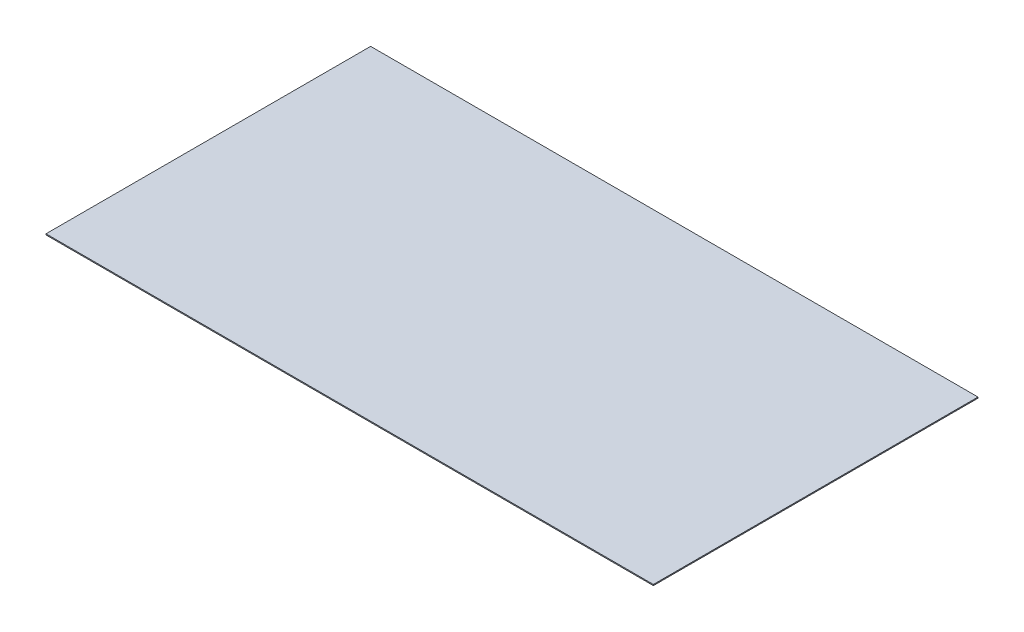
ISO-10303-21;
HEADER;
FILE_DESCRIPTION(('STEP AP214'),'2;1');
FILE_NAME('part.step','',(''),(''),'','','');
FILE_SCHEMA(('AUTOMOTIVE_DESIGN { 1 0 10303 214 1 1 1 1 }'));
ENDSEC;
DATA;
#1=APPLICATION_CONTEXT('core data for automotive mechanical design processes');
#2=APPLICATION_PROTOCOL_DEFINITION('international standard','automotive_design',2000,#1);
#3=PRODUCT_CONTEXT('',#1,'mechanical');
#4=PRODUCT('Part','Part','',(#3));
#5=PRODUCT_RELATED_PRODUCT_CATEGORY('part','',(#4));
#6=PRODUCT_DEFINITION_FORMATION('','',#4);
#7=PRODUCT_DEFINITION_CONTEXT('part definition',#1,'design');
#8=PRODUCT_DEFINITION('design','',#6,#7);
#9=PRODUCT_DEFINITION_SHAPE('','',#8);
#10=(LENGTH_UNIT() NAMED_UNIT(*) SI_UNIT(.MILLI.,.METRE.));
#11=(NAMED_UNIT(*) PLANE_ANGLE_UNIT() SI_UNIT($,.RADIAN.));
#12=(NAMED_UNIT(*) SI_UNIT($,.STERADIAN.) SOLID_ANGLE_UNIT());
#13=UNCERTAINTY_MEASURE_WITH_UNIT(LENGTH_MEASURE(1.E-05),#10,'distance_accuracy_value','');
#14=(GEOMETRIC_REPRESENTATION_CONTEXT(3) GLOBAL_UNCERTAINTY_ASSIGNED_CONTEXT((#13)) GLOBAL_UNIT_ASSIGNED_CONTEXT((#10,
#11,#12)) REPRESENTATION_CONTEXT('',''));
#15=CARTESIAN_POINT('',(0.,0.,0.));
#16=DIRECTION('',(0.,0.,1.));
#17=DIRECTION('',(1.,0.,0.));
#18=AXIS2_PLACEMENT_3D('',#15,#16,#17);
#19=CARTESIAN_POINT('',(290.,1.,155.));
#20=DIRECTION('',(-1.,0.,0.));
#21=DIRECTION('',(0.,0.,1.));
#22=AXIS2_PLACEMENT_3D('',#19,#20,#21);
#23=PLANE('',#22);
#24=DIRECTION('',(0.,0.,-1.));
#25=VECTOR('',#24,1.);
#26=CARTESIAN_POINT('',(290.,0.,155.));
#27=LINE('',#26,#25);
#28=CARTESIAN_POINT('',(290.,0.,155.));
#29=VERTEX_POINT('',#28);
#30=CARTESIAN_POINT('',(290.,0.,-155.));
#31=VERTEX_POINT('',#30);
#32=EDGE_CURVE('E96',#29,#31,#27,.T.);
#33=ORIENTED_EDGE('',*,*,#32,.T.);
#34=DIRECTION('',(0.,-1.,0.));
#35=VECTOR('',#34,1.);
#36=CARTESIAN_POINT('',(290.,1.,-155.));
#37=LINE('',#36,#35);
#38=CARTESIAN_POINT('',(290.,1.,-155.));
#39=VERTEX_POINT('',#38);
#40=EDGE_CURVE('E11',#39,#31,#37,.T.);
#41=ORIENTED_EDGE('',*,*,#40,.F.);
#42=DIRECTION('',(0.,0.,-1.));
#43=VECTOR('',#42,1.);
#44=CARTESIAN_POINT('',(290.,1.,155.));
#45=LINE('',#44,#43);
#46=CARTESIAN_POINT('',(290.,1.,155.));
#47=VERTEX_POINT('',#46);
#48=EDGE_CURVE('E84',#47,#39,#45,.T.);
#49=ORIENTED_EDGE('',*,*,#48,.F.);
#50=DIRECTION('',(0.,-1.,0.));
#51=VECTOR('',#50,1.);
#52=CARTESIAN_POINT('',(290.,1.,155.));
#53=LINE('',#52,#51);
#54=EDGE_CURVE('E92',#47,#29,#53,.T.);
#55=ORIENTED_EDGE('',*,*,#54,.T.);
#56=EDGE_LOOP('',(#33,#41,#49,#55));
#57=FACE_BOUND('',#56,.T.);
#58=ADVANCED_FACE('F33',(#57),#23,.F.);
#59=CARTESIAN_POINT('',(-290.,1.,-155.));
#60=DIRECTION('',(0.,0.,1.));
#61=DIRECTION('',(1.,0.,0.));
#62=AXIS2_PLACEMENT_3D('',#59,#60,#61);
#63=PLANE('',#62);
#64=DIRECTION('',(-1.,0.,0.));
#65=VECTOR('',#64,1.);
#66=CARTESIAN_POINT('',(-290.,0.,-155.));
#67=LINE('',#66,#65);
#68=CARTESIAN_POINT('',(-290.,0.,-155.));
#69=VERTEX_POINT('',#68);
#70=EDGE_CURVE('E88',#31,#69,#67,.T.);
#71=ORIENTED_EDGE('',*,*,#70,.T.);
#72=DIRECTION('',(0.,-1.,0.));
#73=VECTOR('',#72,1.);
#74=CARTESIAN_POINT('',(-290.,1.,-155.));
#75=LINE('',#74,#73);
#76=CARTESIAN_POINT('',(-290.,1.,-155.));
#77=VERTEX_POINT('',#76);
#78=EDGE_CURVE('E41',#77,#69,#75,.T.);
#79=ORIENTED_EDGE('',*,*,#78,.F.);
#80=DIRECTION('',(-1.,0.,0.));
#81=VECTOR('',#80,1.);
#82=CARTESIAN_POINT('',(-290.,1.,-155.));
#83=LINE('',#82,#81);
#84=EDGE_CURVE('E79',#39,#77,#83,.T.);
#85=ORIENTED_EDGE('',*,*,#84,.F.);
#86=ORIENTED_EDGE('',*,*,#40,.T.);
#87=EDGE_LOOP('',(#71,#79,#85,#86));
#88=FACE_BOUND('',#87,.T.);
#89=ADVANCED_FACE('F87',(#88),#63,.F.);
#90=CARTESIAN_POINT('',(-290.,1.,155.));
#91=DIRECTION('',(1.,0.,0.));
#92=DIRECTION('',(0.,0.,-1.));
#93=AXIS2_PLACEMENT_3D('',#90,#91,#92);
#94=PLANE('',#93);
#95=DIRECTION('',(0.,0.,1.));
#96=VECTOR('',#95,1.);
#97=CARTESIAN_POINT('',(-290.,0.,155.));
#98=LINE('',#97,#96);
#99=CARTESIAN_POINT('',(-290.,0.,155.));
#100=VERTEX_POINT('',#99);
#101=EDGE_CURVE('E66',#69,#100,#98,.T.);
#102=ORIENTED_EDGE('',*,*,#101,.T.);
#103=DIRECTION('',(0.,-1.,0.));
#104=VECTOR('',#103,1.);
#105=CARTESIAN_POINT('',(-290.,1.,155.));
#106=LINE('',#105,#104);
#107=CARTESIAN_POINT('',(-290.,1.,155.));
#108=VERTEX_POINT('',#107);
#109=EDGE_CURVE('E89',#108,#100,#106,.T.);
#110=ORIENTED_EDGE('',*,*,#109,.F.);
#111=DIRECTION('',(0.,0.,1.));
#112=VECTOR('',#111,1.);
#113=CARTESIAN_POINT('',(-290.,1.,155.));
#114=LINE('',#113,#112);
#115=EDGE_CURVE('E82',#77,#108,#114,.T.);
#116=ORIENTED_EDGE('',*,*,#115,.F.);
#117=ORIENTED_EDGE('',*,*,#78,.T.);
#118=EDGE_LOOP('',(#102,#110,#116,#117));
#119=FACE_BOUND('',#118,.T.);
#120=ADVANCED_FACE('F90',(#119),#94,.F.);
#121=CARTESIAN_POINT('',(-290.,1.,155.));
#122=DIRECTION('',(0.,0.,-1.));
#123=DIRECTION('',(-1.,0.,0.));
#124=AXIS2_PLACEMENT_3D('',#121,#122,#123);
#125=PLANE('',#124);
#126=DIRECTION('',(1.,0.,0.));
#127=VECTOR('',#126,1.);
#128=CARTESIAN_POINT('',(-290.,0.,155.));
#129=LINE('',#128,#127);
#130=EDGE_CURVE('E72',#100,#29,#129,.T.);
#131=ORIENTED_EDGE('',*,*,#130,.T.);
#132=ORIENTED_EDGE('',*,*,#54,.F.);
#133=DIRECTION('',(1.,0.,0.));
#134=VECTOR('',#133,1.);
#135=CARTESIAN_POINT('',(-290.,1.,155.));
#136=LINE('',#135,#134);
#137=EDGE_CURVE('E49',#108,#47,#136,.T.);
#138=ORIENTED_EDGE('',*,*,#137,.F.);
#139=ORIENTED_EDGE('',*,*,#109,.T.);
#140=EDGE_LOOP('',(#131,#132,#138,#139));
#141=FACE_BOUND('',#140,.T.);
#142=ADVANCED_FACE('F103',(#141),#125,.F.);
#143=CARTESIAN_POINT('',(0.,1.,0.));
#144=DIRECTION('',(0.,-1.,0.));
#145=DIRECTION('',(0.,0.,-1.));
#146=AXIS2_PLACEMENT_3D('',#143,#144,#145);
#147=PLANE('',#146);
#148=ORIENTED_EDGE('',*,*,#48,.T.);
#149=ORIENTED_EDGE('',*,*,#84,.T.);
#150=ORIENTED_EDGE('',*,*,#115,.T.);
#151=ORIENTED_EDGE('',*,*,#137,.T.);
#152=EDGE_LOOP('',(#148,#149,#150,#151));
#153=FACE_BOUND('',#152,.T.);
#154=ADVANCED_FACE('F80',(#153),#147,.F.);
#155=CARTESIAN_POINT('',(0.,0.,0.));
#156=DIRECTION('',(0.,-1.,0.));
#157=DIRECTION('',(0.,0.,-1.));
#158=AXIS2_PLACEMENT_3D('',#155,#156,#157);
#159=PLANE('',#158);
#160=ORIENTED_EDGE('',*,*,#32,.F.);
#161=ORIENTED_EDGE('',*,*,#130,.F.);
#162=ORIENTED_EDGE('',*,*,#101,.F.);
#163=ORIENTED_EDGE('',*,*,#70,.F.);
#164=EDGE_LOOP('',(#160,#161,#162,#163));
#165=FACE_BOUND('',#164,.T.);
#166=ADVANCED_FACE('F106',(#165),#159,.T.);
#167=CLOSED_SHELL('',(#58,#89,#120,#142,#154,#166));
#168=MANIFOLD_SOLID_BREP('B2',#167);
#169=ADVANCED_BREP_SHAPE_REPRESENTATION('',(#18,#168),#14);
#170=SHAPE_DEFINITION_REPRESENTATION(#9,#169);
ENDSEC;
END-ISO-10303-21;
